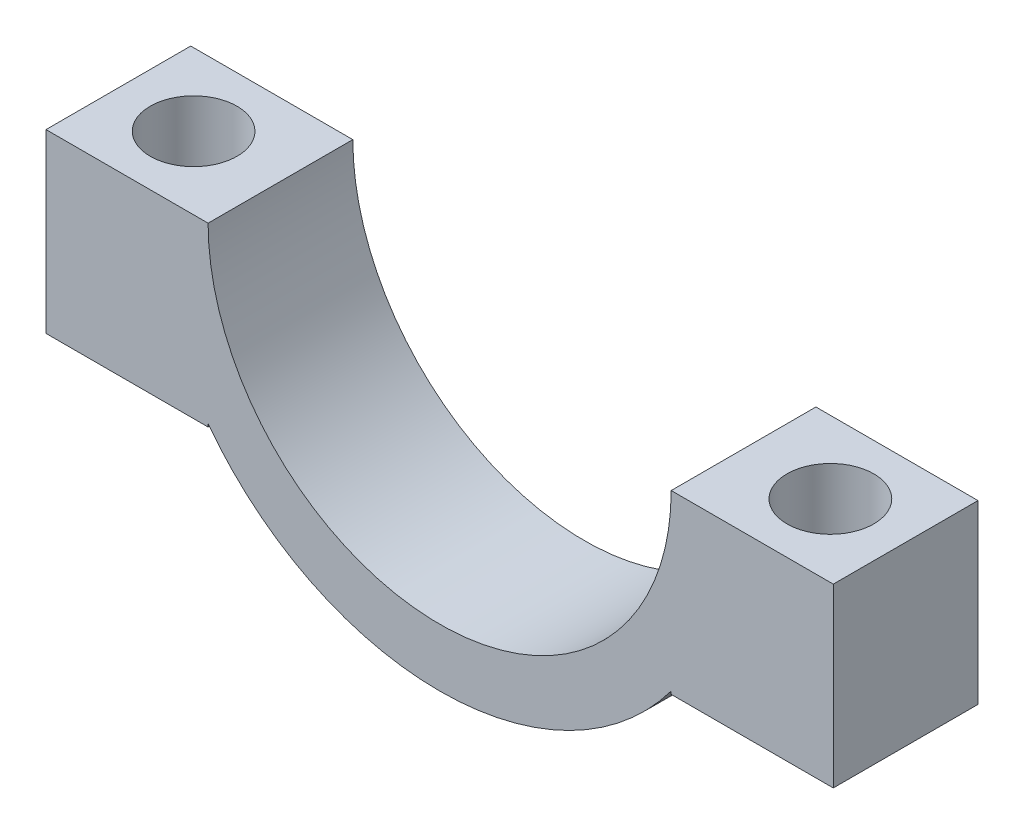
ISO-10303-21;
HEADER;
FILE_DESCRIPTION(('STEP AP214'),'2;1');
FILE_NAME('part.step','',(''),(''),'','','');
FILE_SCHEMA(('AUTOMOTIVE_DESIGN { 1 0 10303 214 1 1 1 1 }'));
ENDSEC;
DATA;
#1=APPLICATION_CONTEXT('core data for automotive mechanical design processes');
#2=APPLICATION_PROTOCOL_DEFINITION('international standard','automotive_design',2000,#1);
#3=PRODUCT_CONTEXT('',#1,'mechanical');
#4=PRODUCT('Part','Part','',(#3));
#5=PRODUCT_RELATED_PRODUCT_CATEGORY('part','',(#4));
#6=PRODUCT_DEFINITION_FORMATION('','',#4);
#7=PRODUCT_DEFINITION_CONTEXT('part definition',#1,'design');
#8=PRODUCT_DEFINITION('design','',#6,#7);
#9=PRODUCT_DEFINITION_SHAPE('','',#8);
#10=(LENGTH_UNIT() NAMED_UNIT(*) SI_UNIT(.MILLI.,.METRE.));
#11=(NAMED_UNIT(*) PLANE_ANGLE_UNIT() SI_UNIT($,.RADIAN.));
#12=(NAMED_UNIT(*) SI_UNIT($,.STERADIAN.) SOLID_ANGLE_UNIT());
#13=UNCERTAINTY_MEASURE_WITH_UNIT(LENGTH_MEASURE(1.E-05),#10,'distance_accuracy_value','');
#14=(GEOMETRIC_REPRESENTATION_CONTEXT(3) GLOBAL_UNCERTAINTY_ASSIGNED_CONTEXT((#13)) GLOBAL_UNIT_ASSIGNED_CONTEXT((#10,
#11,#12)) REPRESENTATION_CONTEXT('',''));
#15=CARTESIAN_POINT('',(0.,0.,0.));
#16=DIRECTION('',(0.,0.,1.));
#17=DIRECTION('',(1.,0.,0.));
#18=AXIS2_PLACEMENT_3D('',#15,#16,#17);
#19=CARTESIAN_POINT('',(-8.,0.,5.));
#20=DIRECTION('',(1.,0.,0.));
#21=DIRECTION('',(0.,1.,0.));
#22=AXIS2_PLACEMENT_3D('',#19,#20,#21);
#23=PLANE('',#22);
#24=DIRECTION('',(0.,-1.,0.));
#25=VECTOR('',#24,1.);
#26=CARTESIAN_POINT('',(-8.,0.,0.));
#27=LINE('',#26,#25);
#28=CARTESIAN_POINT('',(-8.,-6.00000000000001,0.));
#29=VERTEX_POINT('',#28);
#30=CARTESIAN_POINT('',(-8.,-6.1,0.));
#31=VERTEX_POINT('',#30);
#32=EDGE_CURVE('E149',#29,#31,#27,.T.);
#33=ORIENTED_EDGE('',*,*,#32,.F.);
#34=DIRECTION('',(0.,0.,-1.));
#35=VECTOR('',#34,1.);
#36=CARTESIAN_POINT('',(-8.,-6.00000000000001,5.));
#37=LINE('',#36,#35);
#38=CARTESIAN_POINT('',(-8.,-6.00000000000001,5.));
#39=VERTEX_POINT('',#38);
#40=EDGE_CURVE('E12',#39,#29,#37,.T.);
#41=ORIENTED_EDGE('',*,*,#40,.F.);
#42=DIRECTION('',(0.,-1.,0.));
#43=VECTOR('',#42,1.);
#44=CARTESIAN_POINT('',(-8.,0.,5.));
#45=LINE('',#44,#43);
#46=CARTESIAN_POINT('',(-8.,-6.1,5.));
#47=VERTEX_POINT('',#46);
#48=EDGE_CURVE('E199',#39,#47,#45,.T.);
#49=ORIENTED_EDGE('',*,*,#48,.T.);
#50=DIRECTION('',(0.,0.,-1.));
#51=VECTOR('',#50,1.);
#52=CARTESIAN_POINT('',(-8.,-6.1,5.));
#53=LINE('',#52,#51);
#54=EDGE_CURVE('E100',#47,#31,#53,.T.);
#55=ORIENTED_EDGE('',*,*,#54,.T.);
#56=EDGE_LOOP('',(#33,#41,#49,#55));
#57=FACE_BOUND('',#56,.T.);
#58=ADVANCED_FACE('F41',(#57),#23,.T.);
#59=CARTESIAN_POINT('',(0.,0.,5.));
#60=DIRECTION('',(0.,0.,-1.));
#61=DIRECTION('',(-1.,0.,0.));
#62=AXIS2_PLACEMENT_3D('',#59,#60,#61);
#63=CYLINDRICAL_SURFACE('',#62,10.);
#64=CARTESIAN_POINT('',(0.,0.,0.));
#65=DIRECTION('',(0.,0.,1.));
#66=DIRECTION('',(1.,0.,0.));
#67=AXIS2_PLACEMENT_3D('',#64,#65,#66);
#68=CIRCLE('',#67,10.);
#69=CARTESIAN_POINT('',(8.,-6.,0.));
#70=VERTEX_POINT('',#69);
#71=EDGE_CURVE('E178',#29,#70,#68,.T.);
#72=ORIENTED_EDGE('',*,*,#71,.T.);
#73=DIRECTION('',(0.,0.,-1.));
#74=VECTOR('',#73,1.);
#75=CARTESIAN_POINT('',(8.,-6.,5.));
#76=LINE('',#75,#74);
#77=CARTESIAN_POINT('',(8.,-6.,5.));
#78=VERTEX_POINT('',#77);
#79=EDGE_CURVE('E51',#78,#70,#76,.T.);
#80=ORIENTED_EDGE('',*,*,#79,.F.);
#81=CARTESIAN_POINT('',(0.,0.,5.));
#82=DIRECTION('',(0.,0.,1.));
#83=DIRECTION('',(1.,0.,0.));
#84=AXIS2_PLACEMENT_3D('',#81,#82,#83);
#85=CIRCLE('',#84,10.);
#86=EDGE_CURVE('E235',#39,#78,#85,.T.);
#87=ORIENTED_EDGE('',*,*,#86,.F.);
#88=ORIENTED_EDGE('',*,*,#40,.T.);
#89=EDGE_LOOP('',(#72,#80,#87,#88));
#90=FACE_BOUND('',#89,.T.);
#91=ADVANCED_FACE('F259',(#90),#63,.T.);
#92=CARTESIAN_POINT('',(8.,0.,5.));
#93=DIRECTION('',(1.,0.,0.));
#94=DIRECTION('',(0.,0.,-1.));
#95=AXIS2_PLACEMENT_3D('',#92,#93,#94);
#96=PLANE('',#95);
#97=DIRECTION('',(0.,-1.,0.));
#98=VECTOR('',#97,1.);
#99=CARTESIAN_POINT('',(8.,0.,0.));
#100=LINE('',#99,#98);
#101=CARTESIAN_POINT('',(8.,-6.1,0.));
#102=VERTEX_POINT('',#101);
#103=EDGE_CURVE('E170',#70,#102,#100,.T.);
#104=ORIENTED_EDGE('',*,*,#103,.T.);
#105=DIRECTION('',(0.,0.,-1.));
#106=VECTOR('',#105,1.);
#107=CARTESIAN_POINT('',(8.,-6.1,5.));
#108=LINE('',#107,#106);
#109=CARTESIAN_POINT('',(8.,-6.1,5.));
#110=VERTEX_POINT('',#109);
#111=EDGE_CURVE('E155',#110,#102,#108,.T.);
#112=ORIENTED_EDGE('',*,*,#111,.F.);
#113=DIRECTION('',(0.,-1.,0.));
#114=VECTOR('',#113,1.);
#115=CARTESIAN_POINT('',(8.,0.,5.));
#116=LINE('',#115,#114);
#117=EDGE_CURVE('E172',#78,#110,#116,.T.);
#118=ORIENTED_EDGE('',*,*,#117,.F.);
#119=ORIENTED_EDGE('',*,*,#79,.T.);
#120=EDGE_LOOP('',(#104,#112,#118,#119));
#121=FACE_BOUND('',#120,.T.);
#122=ADVANCED_FACE('F168',(#121),#96,.F.);
#123=CARTESIAN_POINT('',(0.,-6.1,5.));
#124=DIRECTION('',(0.,-1.,0.));
#125=DIRECTION('',(1.,0.,0.));
#126=AXIS2_PLACEMENT_3D('',#123,#124,#125);
#127=PLANE('',#126);
#128=CARTESIAN_POINT('',(11.,-6.1,2.49999999999884));
#129=DIRECTION('',(0.,-1.,0.));
#130=DIRECTION('',(1.,0.,0.));
#131=AXIS2_PLACEMENT_3D('',#128,#129,#130);
#132=CIRCLE('',#131,1.5);
#133=CARTESIAN_POINT('',(12.5,-6.1,2.49999999999884));
#134=VERTEX_POINT('',#133);
#135=EDGE_CURVE('E240',#134,#134,#132,.T.);
#136=ORIENTED_EDGE('',*,*,#135,.F.);
#137=EDGE_LOOP('',(#136));
#138=FACE_BOUND('',#137,.T.);
#139=DIRECTION('',(-1.,0.,0.));
#140=VECTOR('',#139,1.);
#141=CARTESIAN_POINT('',(0.,-6.1,0.));
#142=LINE('',#141,#140);
#143=CARTESIAN_POINT('',(13.6,-6.1,0.));
#144=VERTEX_POINT('',#143);
#145=EDGE_CURVE('E181',#144,#102,#142,.T.);
#146=ORIENTED_EDGE('',*,*,#145,.F.);
#147=DIRECTION('',(0.,0.,-1.));
#148=VECTOR('',#147,1.);
#149=CARTESIAN_POINT('',(13.6,-6.1,5.));
#150=LINE('',#149,#148);
#151=CARTESIAN_POINT('',(13.6,-6.1,5.));
#152=VERTEX_POINT('',#151);
#153=EDGE_CURVE('E159',#152,#144,#150,.T.);
#154=ORIENTED_EDGE('',*,*,#153,.F.);
#155=DIRECTION('',(-1.,0.,0.));
#156=VECTOR('',#155,1.);
#157=CARTESIAN_POINT('',(0.,-6.1,5.));
#158=LINE('',#157,#156);
#159=EDGE_CURVE('E231',#152,#110,#158,.T.);
#160=ORIENTED_EDGE('',*,*,#159,.T.);
#161=ORIENTED_EDGE('',*,*,#111,.T.);
#162=EDGE_LOOP('',(#146,#154,#160,#161));
#163=FACE_BOUND('',#162,.T.);
#164=ADVANCED_FACE('F223',(#138,#163),#127,.T.);
#165=CARTESIAN_POINT('',(13.6,0.,5.));
#166=DIRECTION('',(1.,0.,0.));
#167=DIRECTION('',(0.,0.,-1.));
#168=AXIS2_PLACEMENT_3D('',#165,#166,#167);
#169=PLANE('',#168);
#170=DIRECTION('',(0.,-1.,0.));
#171=VECTOR('',#170,1.);
#172=CARTESIAN_POINT('',(13.6,0.,0.));
#173=LINE('',#172,#171);
#174=CARTESIAN_POINT('',(13.6,0.,0.));
#175=VERTEX_POINT('',#174);
#176=EDGE_CURVE('E183',#175,#144,#173,.T.);
#177=ORIENTED_EDGE('',*,*,#176,.F.);
#178=DIRECTION('',(0.,0.,-1.));
#179=VECTOR('',#178,1.);
#180=CARTESIAN_POINT('',(13.6,0.,5.));
#181=LINE('',#180,#179);
#182=CARTESIAN_POINT('',(13.6,0.,5.));
#183=VERTEX_POINT('',#182);
#184=EDGE_CURVE('E210',#183,#175,#181,.T.);
#185=ORIENTED_EDGE('',*,*,#184,.F.);
#186=DIRECTION('',(0.,-1.,0.));
#187=VECTOR('',#186,1.);
#188=CARTESIAN_POINT('',(13.6,0.,5.));
#189=LINE('',#188,#187);
#190=EDGE_CURVE('E219',#183,#152,#189,.T.);
#191=ORIENTED_EDGE('',*,*,#190,.T.);
#192=ORIENTED_EDGE('',*,*,#153,.T.);
#193=EDGE_LOOP('',(#177,#185,#191,#192));
#194=FACE_BOUND('',#193,.T.);
#195=ADVANCED_FACE('F217',(#194),#169,.T.);
#196=CARTESIAN_POINT('',(0.,0.,5.));
#197=DIRECTION('',(0.,1.,0.));
#198=DIRECTION('',(0.,0.,1.));
#199=AXIS2_PLACEMENT_3D('',#196,#197,#198);
#200=PLANE('',#199);
#201=CARTESIAN_POINT('',(11.,0.,2.49999999999884));
#202=DIRECTION('',(0.,1.,0.));
#203=DIRECTION('',(-1.,0.,0.));
#204=AXIS2_PLACEMENT_3D('',#201,#202,#203);
#205=CIRCLE('',#204,1.5);
#206=CARTESIAN_POINT('',(9.5,0.,2.49999999999884));
#207=VERTEX_POINT('',#206);
#208=EDGE_CURVE('E244',#207,#207,#205,.T.);
#209=ORIENTED_EDGE('',*,*,#208,.F.);
#210=EDGE_LOOP('',(#209));
#211=FACE_BOUND('',#210,.T.);
#212=DIRECTION('',(1.,0.,0.));
#213=VECTOR('',#212,1.);
#214=CARTESIAN_POINT('',(0.,0.,0.));
#215=LINE('',#214,#213);
#216=CARTESIAN_POINT('',(8.,0.,0.));
#217=VERTEX_POINT('',#216);
#218=EDGE_CURVE('E188',#217,#175,#215,.T.);
#219=ORIENTED_EDGE('',*,*,#218,.F.);
#220=DIRECTION('',(0.,0.,-1.));
#221=VECTOR('',#220,1.);
#222=CARTESIAN_POINT('',(8.,0.,5.));
#223=LINE('',#222,#221);
#224=CARTESIAN_POINT('',(8.,0.,5.));
#225=VERTEX_POINT('',#224);
#226=EDGE_CURVE('E209',#225,#217,#223,.T.);
#227=ORIENTED_EDGE('',*,*,#226,.F.);
#228=DIRECTION('',(1.,0.,0.));
#229=VECTOR('',#228,1.);
#230=CARTESIAN_POINT('',(0.,0.,5.));
#231=LINE('',#230,#229);
#232=EDGE_CURVE('E226',#225,#183,#231,.T.);
#233=ORIENTED_EDGE('',*,*,#232,.T.);
#234=ORIENTED_EDGE('',*,*,#184,.T.);
#235=EDGE_LOOP('',(#219,#227,#233,#234));
#236=FACE_BOUND('',#235,.T.);
#237=ADVANCED_FACE('F225',(#211,#236),#200,.T.);
#238=CARTESIAN_POINT('',(0.,0.,5.));
#239=DIRECTION('',(0.,0.,-1.));
#240=DIRECTION('',(-1.,0.,0.));
#241=AXIS2_PLACEMENT_3D('',#238,#239,#240);
#242=CYLINDRICAL_SURFACE('',#241,8.);
#243=CARTESIAN_POINT('',(0.,0.,0.));
#244=DIRECTION('',(0.,0.,1.));
#245=DIRECTION('',(1.,0.,0.));
#246=AXIS2_PLACEMENT_3D('',#243,#244,#245);
#247=CIRCLE('',#246,8.);
#248=CARTESIAN_POINT('',(-8.,0.,0.));
#249=VERTEX_POINT('',#248);
#250=EDGE_CURVE('E191',#249,#217,#247,.T.);
#251=ORIENTED_EDGE('',*,*,#250,.F.);
#252=DIRECTION('',(0.,0.,-1.));
#253=VECTOR('',#252,1.);
#254=CARTESIAN_POINT('',(-8.,0.,5.));
#255=LINE('',#254,#253);
#256=CARTESIAN_POINT('',(-8.,0.,5.));
#257=VERTEX_POINT('',#256);
#258=EDGE_CURVE('E140',#257,#249,#255,.T.);
#259=ORIENTED_EDGE('',*,*,#258,.F.);
#260=CARTESIAN_POINT('',(0.,0.,5.));
#261=DIRECTION('',(0.,0.,1.));
#262=DIRECTION('',(1.,0.,0.));
#263=AXIS2_PLACEMENT_3D('',#260,#261,#262);
#264=CIRCLE('',#263,8.);
#265=EDGE_CURVE('E133',#257,#225,#264,.T.);
#266=ORIENTED_EDGE('',*,*,#265,.T.);
#267=ORIENTED_EDGE('',*,*,#226,.T.);
#268=EDGE_LOOP('',(#251,#259,#266,#267));
#269=FACE_BOUND('',#268,.T.);
#270=ADVANCED_FACE('F229',(#269),#242,.F.);
#271=CARTESIAN_POINT('',(0.,0.,5.));
#272=DIRECTION('',(0.,-1.,0.));
#273=DIRECTION('',(1.,0.,0.));
#274=AXIS2_PLACEMENT_3D('',#271,#272,#273);
#275=PLANE('',#274);
#276=CARTESIAN_POINT('',(-11.,0.,2.49999999999886));
#277=DIRECTION('',(0.,1.,0.));
#278=DIRECTION('',(-1.,0.,0.));
#279=AXIS2_PLACEMENT_3D('',#276,#277,#278);
#280=CIRCLE('',#279,1.5);
#281=CARTESIAN_POINT('',(-12.5,0.,2.49999999999886));
#282=VERTEX_POINT('',#281);
#283=EDGE_CURVE('E238',#282,#282,#280,.T.);
#284=ORIENTED_EDGE('',*,*,#283,.F.);
#285=EDGE_LOOP('',(#284));
#286=FACE_BOUND('',#285,.T.);
#287=DIRECTION('',(-1.,0.,0.));
#288=VECTOR('',#287,1.);
#289=CARTESIAN_POINT('',(0.,0.,0.));
#290=LINE('',#289,#288);
#291=CARTESIAN_POINT('',(-13.6,0.,0.));
#292=VERTEX_POINT('',#291);
#293=EDGE_CURVE('E139',#249,#292,#290,.T.);
#294=ORIENTED_EDGE('',*,*,#293,.T.);
#295=DIRECTION('',(0.,0.,-1.));
#296=VECTOR('',#295,1.);
#297=CARTESIAN_POINT('',(-13.6,0.,5.));
#298=LINE('',#297,#296);
#299=CARTESIAN_POINT('',(-13.6,0.,5.));
#300=VERTEX_POINT('',#299);
#301=EDGE_CURVE('E136',#300,#292,#298,.T.);
#302=ORIENTED_EDGE('',*,*,#301,.F.);
#303=DIRECTION('',(-1.,0.,0.));
#304=VECTOR('',#303,1.);
#305=CARTESIAN_POINT('',(0.,0.,5.));
#306=LINE('',#305,#304);
#307=EDGE_CURVE('E126',#257,#300,#306,.T.);
#308=ORIENTED_EDGE('',*,*,#307,.F.);
#309=ORIENTED_EDGE('',*,*,#258,.T.);
#310=EDGE_LOOP('',(#294,#302,#308,#309));
#311=FACE_BOUND('',#310,.T.);
#312=ADVANCED_FACE('F137',(#286,#311),#275,.F.);
#313=CARTESIAN_POINT('',(-13.6,0.,5.));
#314=DIRECTION('',(1.,0.,0.));
#315=DIRECTION('',(0.,0.,-1.));
#316=AXIS2_PLACEMENT_3D('',#313,#314,#315);
#317=PLANE('',#316);
#318=DIRECTION('',(0.,-1.,0.));
#319=VECTOR('',#318,1.);
#320=CARTESIAN_POINT('',(-13.6,0.,0.));
#321=LINE('',#320,#319);
#322=CARTESIAN_POINT('',(-13.6,-6.1,0.));
#323=VERTEX_POINT('',#322);
#324=EDGE_CURVE('E93',#292,#323,#321,.T.);
#325=ORIENTED_EDGE('',*,*,#324,.T.);
#326=DIRECTION('',(0.,0.,-1.));
#327=VECTOR('',#326,1.);
#328=CARTESIAN_POINT('',(-13.6,-6.1,5.));
#329=LINE('',#328,#327);
#330=CARTESIAN_POINT('',(-13.6,-6.1,5.));
#331=VERTEX_POINT('',#330);
#332=EDGE_CURVE('E141',#331,#323,#329,.T.);
#333=ORIENTED_EDGE('',*,*,#332,.F.);
#334=DIRECTION('',(0.,-1.,0.));
#335=VECTOR('',#334,1.);
#336=CARTESIAN_POINT('',(-13.6,0.,5.));
#337=LINE('',#336,#335);
#338=EDGE_CURVE('E130',#300,#331,#337,.T.);
#339=ORIENTED_EDGE('',*,*,#338,.F.);
#340=ORIENTED_EDGE('',*,*,#301,.T.);
#341=EDGE_LOOP('',(#325,#333,#339,#340));
#342=FACE_BOUND('',#341,.T.);
#343=ADVANCED_FACE('F143',(#342),#317,.F.);
#344=CARTESIAN_POINT('',(0.,-6.1,5.));
#345=DIRECTION('',(0.,1.,0.));
#346=DIRECTION('',(0.,0.,1.));
#347=AXIS2_PLACEMENT_3D('',#344,#345,#346);
#348=PLANE('',#347);
#349=CARTESIAN_POINT('',(-11.,-6.1,2.49999999999886));
#350=DIRECTION('',(0.,1.,0.));
#351=DIRECTION('',(0.,0.,1.));
#352=AXIS2_PLACEMENT_3D('',#349,#350,#351);
#353=CIRCLE('',#352,1.5);
#354=CARTESIAN_POINT('',(-11.,-6.1,3.99999999999886));
#355=VERTEX_POINT('',#354);
#356=EDGE_CURVE('E44',#355,#355,#353,.T.);
#357=ORIENTED_EDGE('',*,*,#356,.T.);
#358=EDGE_LOOP('',(#357));
#359=FACE_BOUND('',#358,.T.);
#360=DIRECTION('',(1.,0.,0.));
#361=VECTOR('',#360,1.);
#362=CARTESIAN_POINT('',(0.,-6.1,0.));
#363=LINE('',#362,#361);
#364=EDGE_CURVE('E196',#323,#31,#363,.T.);
#365=ORIENTED_EDGE('',*,*,#364,.T.);
#366=ORIENTED_EDGE('',*,*,#54,.F.);
#367=DIRECTION('',(1.,0.,0.));
#368=VECTOR('',#367,1.);
#369=CARTESIAN_POINT('',(0.,-6.1,5.));
#370=LINE('',#369,#368);
#371=EDGE_CURVE('E59',#331,#47,#370,.T.);
#372=ORIENTED_EDGE('',*,*,#371,.F.);
#373=ORIENTED_EDGE('',*,*,#332,.T.);
#374=EDGE_LOOP('',(#365,#366,#372,#373));
#375=FACE_BOUND('',#374,.T.);
#376=ADVANCED_FACE('F267',(#359,#375),#348,.F.);
#377=CARTESIAN_POINT('',(0.,0.,5.));
#378=DIRECTION('',(0.,0.,1.));
#379=DIRECTION('',(1.,0.,0.));
#380=AXIS2_PLACEMENT_3D('',#377,#378,#379);
#381=PLANE('',#380);
#382=ORIENTED_EDGE('',*,*,#48,.F.);
#383=ORIENTED_EDGE('',*,*,#86,.T.);
#384=ORIENTED_EDGE('',*,*,#117,.T.);
#385=ORIENTED_EDGE('',*,*,#159,.F.);
#386=ORIENTED_EDGE('',*,*,#190,.F.);
#387=ORIENTED_EDGE('',*,*,#232,.F.);
#388=ORIENTED_EDGE('',*,*,#265,.F.);
#389=ORIENTED_EDGE('',*,*,#307,.T.);
#390=ORIENTED_EDGE('',*,*,#338,.T.);
#391=ORIENTED_EDGE('',*,*,#371,.T.);
#392=EDGE_LOOP('',(#382,#383,#384,#385,#386,#387,#388,#389,#390,#391));
#393=FACE_BOUND('',#392,.T.);
#394=ADVANCED_FACE('F128',(#393),#381,.T.);
#395=CARTESIAN_POINT('',(0.,0.,0.));
#396=DIRECTION('',(0.,0.,1.));
#397=DIRECTION('',(1.,0.,0.));
#398=AXIS2_PLACEMENT_3D('',#395,#396,#397);
#399=PLANE('',#398);
#400=ORIENTED_EDGE('',*,*,#32,.T.);
#401=ORIENTED_EDGE('',*,*,#364,.F.);
#402=ORIENTED_EDGE('',*,*,#324,.F.);
#403=ORIENTED_EDGE('',*,*,#293,.F.);
#404=ORIENTED_EDGE('',*,*,#250,.T.);
#405=ORIENTED_EDGE('',*,*,#218,.T.);
#406=ORIENTED_EDGE('',*,*,#176,.T.);
#407=ORIENTED_EDGE('',*,*,#145,.T.);
#408=ORIENTED_EDGE('',*,*,#103,.F.);
#409=ORIENTED_EDGE('',*,*,#71,.F.);
#410=EDGE_LOOP('',(#400,#401,#402,#403,#404,#405,#406,#407,#408,#409));
#411=FACE_BOUND('',#410,.T.);
#412=ADVANCED_FACE('F177',(#411),#399,.F.);
#413=CARTESIAN_POINT('',(-11.,-10.,2.49999999999886));
#414=DIRECTION('',(0.,1.,0.));
#415=DIRECTION('',(-1.,0.,0.));
#416=AXIS2_PLACEMENT_3D('',#413,#414,#415);
#417=CYLINDRICAL_SURFACE('',#416,1.5);
#418=ORIENTED_EDGE('',*,*,#283,.T.);
#419=EDGE_LOOP('',(#418));
#420=FACE_BOUND('',#419,.T.);
#421=ORIENTED_EDGE('',*,*,#356,.F.);
#422=EDGE_LOOP('',(#421));
#423=FACE_BOUND('',#422,.T.);
#424=ADVANCED_FACE('F270',(#420,#423),#417,.F.);
#425=CARTESIAN_POINT('',(11.,-10.,2.49999999999884));
#426=DIRECTION('',(0.,1.,0.));
#427=DIRECTION('',(-1.,0.,0.));
#428=AXIS2_PLACEMENT_3D('',#425,#426,#427);
#429=CYLINDRICAL_SURFACE('',#428,1.5);
#430=ORIENTED_EDGE('',*,*,#135,.T.);
#431=EDGE_LOOP('',(#430));
#432=FACE_BOUND('',#431,.T.);
#433=ORIENTED_EDGE('',*,*,#208,.T.);
#434=EDGE_LOOP('',(#433));
#435=FACE_BOUND('',#434,.T.);
#436=ADVANCED_FACE('F248',(#432,#435),#429,.F.);
#437=CLOSED_SHELL('',(#58,#91,#122,#164,#195,#237,#270,#312,#343,#376,#394,#412,#424,#436));
#438=MANIFOLD_SOLID_BREP('B2',#437);
#439=ADVANCED_BREP_SHAPE_REPRESENTATION('',(#18,#438),#14);
#440=SHAPE_DEFINITION_REPRESENTATION(#9,#439);
ENDSEC;
END-ISO-10303-21;
